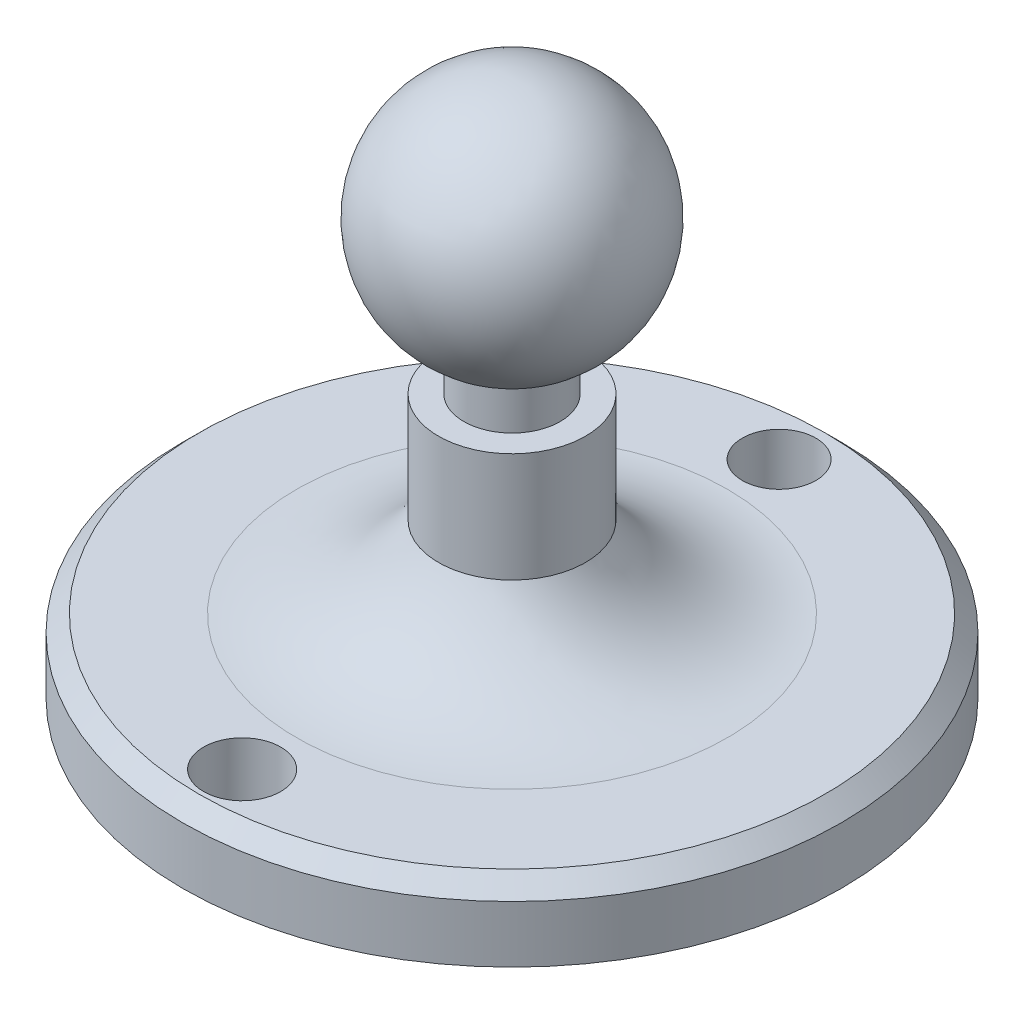
ISO-10303-21;
HEADER;
FILE_DESCRIPTION(('STEP AP214'),'2;1');
FILE_NAME('part.step','',(''),(''),'','','');
FILE_SCHEMA(('AUTOMOTIVE_DESIGN { 1 0 10303 214 1 1 1 1 }'));
ENDSEC;
DATA;
#1=APPLICATION_CONTEXT('core data for automotive mechanical design processes');
#2=APPLICATION_PROTOCOL_DEFINITION('international standard','automotive_design',2000,#1);
#3=PRODUCT_CONTEXT('',#1,'mechanical');
#4=PRODUCT('Part','Part','',(#3));
#5=PRODUCT_RELATED_PRODUCT_CATEGORY('part','',(#4));
#6=PRODUCT_DEFINITION_FORMATION('','',#4);
#7=PRODUCT_DEFINITION_CONTEXT('part definition',#1,'design');
#8=PRODUCT_DEFINITION('design','',#6,#7);
#9=PRODUCT_DEFINITION_SHAPE('','',#8);
#10=(LENGTH_UNIT() NAMED_UNIT(*) SI_UNIT(.MILLI.,.METRE.));
#11=(NAMED_UNIT(*) PLANE_ANGLE_UNIT() SI_UNIT($,.RADIAN.));
#12=(NAMED_UNIT(*) SI_UNIT($,.STERADIAN.) SOLID_ANGLE_UNIT());
#13=UNCERTAINTY_MEASURE_WITH_UNIT(LENGTH_MEASURE(1.E-05),#10,'distance_accuracy_value','');
#14=(GEOMETRIC_REPRESENTATION_CONTEXT(3) GLOBAL_UNCERTAINTY_ASSIGNED_CONTEXT((#13)) GLOBAL_UNIT_ASSIGNED_CONTEXT((#10,
#11,#12)) REPRESENTATION_CONTEXT('',''));
#15=CARTESIAN_POINT('',(0.,0.,0.));
#16=DIRECTION('',(0.,0.,1.));
#17=DIRECTION('',(1.,0.,0.));
#18=AXIS2_PLACEMENT_3D('',#15,#16,#17);
#19=CARTESIAN_POINT('',(0.,0.,0.));
#20=DIRECTION('',(0.,-1.,0.));
#21=DIRECTION('',(0.,0.,-1.));
#22=AXIS2_PLACEMENT_3D('',#19,#20,#21);
#23=PLANE('',#22);
#24=CARTESIAN_POINT('',(0.,0.,-81.0546907449684));
#25=DIRECTION('',(0.,-1.,0.));
#26=DIRECTION('',(0.,0.,-1.));
#27=AXIS2_PLACEMENT_3D('',#24,#25,#26);
#28=CIRCLE('',#27,11.163314546451);
#29=CARTESIAN_POINT('',(0.,0.,-92.2180052914194));
#30=VERTEX_POINT('',#29);
#31=EDGE_CURVE('E70',#30,#30,#28,.T.);
#32=ORIENTED_EDGE('',*,*,#31,.F.);
#33=EDGE_LOOP('',(#32));
#34=FACE_BOUND('',#33,.T.);
#35=CARTESIAN_POINT('',(0.,0.,81.8990104402285));
#36=DIRECTION('',(0.,-1.,0.));
#37=DIRECTION('',(0.,0.,-1.));
#38=AXIS2_PLACEMENT_3D('',#35,#36,#37);
#39=CIRCLE('',#38,11.7087538726197);
#40=CARTESIAN_POINT('',(0.,0.,70.1902565676088));
#41=VERTEX_POINT('',#40);
#42=EDGE_CURVE('E64',#41,#41,#39,.T.);
#43=ORIENTED_EDGE('',*,*,#42,.F.);
#44=EDGE_LOOP('',(#43));
#45=FACE_BOUND('',#44,.T.);
#46=CARTESIAN_POINT('',(0.,0.,0.));
#47=DIRECTION('',(0.,-1.,0.));
#48=DIRECTION('',(0.,0.,-1.));
#49=AXIS2_PLACEMENT_3D('',#46,#47,#48);
#50=CIRCLE('',#49,100.);
#51=CARTESIAN_POINT('',(0.,0.,-100.));
#52=VERTEX_POINT('',#51);
#53=EDGE_CURVE('E43',#52,#52,#50,.T.);
#54=ORIENTED_EDGE('',*,*,#53,.T.);
#55=EDGE_LOOP('',(#54));
#56=FACE_BOUND('',#55,.T.);
#57=ADVANCED_FACE('F32',(#34,#45,#56),#23,.T.);
#58=CARTESIAN_POINT('',(0.,0.,0.));
#59=DIRECTION('',(0.,-1.,0.));
#60=DIRECTION('',(0.,0.,-1.));
#61=AXIS2_PLACEMENT_3D('',#58,#59,#60);
#62=CYLINDRICAL_SURFACE('',#61,100.);
#63=CARTESIAN_POINT('',(0.,17.2445990685214,0.));
#64=DIRECTION('',(0.,1.,0.));
#65=DIRECTION('',(0.,0.,1.));
#66=AXIS2_PLACEMENT_3D('',#63,#64,#65);
#67=CIRCLE('',#66,100.);
#68=CARTESIAN_POINT('',(0.,17.2445990685214,100.));
#69=VERTEX_POINT('',#68);
#70=EDGE_CURVE('E39',#69,#69,#67,.F.);
#71=ORIENTED_EDGE('',*,*,#70,.T.);
#72=EDGE_LOOP('',(#71));
#73=FACE_BOUND('',#72,.T.);
#74=ORIENTED_EDGE('',*,*,#53,.F.);
#75=EDGE_LOOP('',(#74));
#76=FACE_BOUND('',#75,.T.);
#77=ADVANCED_FACE('F83',(#73,#76),#62,.T.);
#78=CARTESIAN_POINT('',(0.,22.2445990685214,-100.));
#79=DIRECTION('',(0.,1.,0.));
#80=DIRECTION('',(0.,0.,1.));
#81=AXIS2_PLACEMENT_3D('',#78,#79,#80);
#82=PLANE('',#81);
#83=CARTESIAN_POINT('',(0.,22.2445990685214,0.));
#84=DIRECTION('',(0.,1.,0.));
#85=DIRECTION('',(0.,0.,1.));
#86=AXIS2_PLACEMENT_3D('',#83,#84,#85);
#87=CIRCLE('',#86,95.);
#88=CARTESIAN_POINT('',(0.,22.2445990685214,95.));
#89=VERTEX_POINT('',#88);
#90=EDGE_CURVE('E10',#89,#89,#87,.T.);
#91=ORIENTED_EDGE('',*,*,#90,.T.);
#92=EDGE_LOOP('',(#91));
#93=FACE_BOUND('',#92,.T.);
#94=CARTESIAN_POINT('',(0.,22.2445990685214,-81.0546907449684));
#95=DIRECTION('',(0.,1.,0.));
#96=DIRECTION('',(0.,0.,1.));
#97=AXIS2_PLACEMENT_3D('',#94,#95,#96);
#98=CIRCLE('',#97,11.163314546451);
#99=CARTESIAN_POINT('',(0.,22.2445990685214,-69.8913761985174));
#100=VERTEX_POINT('',#99);
#101=EDGE_CURVE('E73',#100,#100,#98,.T.);
#102=ORIENTED_EDGE('',*,*,#101,.F.);
#103=EDGE_LOOP('',(#102));
#104=FACE_BOUND('',#103,.T.);
#105=CARTESIAN_POINT('',(0.,22.2445990685214,81.8990104402285));
#106=DIRECTION('',(0.,1.,0.));
#107=DIRECTION('',(0.,0.,1.));
#108=AXIS2_PLACEMENT_3D('',#105,#106,#107);
#109=CIRCLE('',#108,11.7087538726197);
#110=CARTESIAN_POINT('',(0.,22.2445990685214,93.6077643128483));
#111=VERTEX_POINT('',#110);
#112=EDGE_CURVE('E67',#111,#111,#109,.T.);
#113=ORIENTED_EDGE('',*,*,#112,.F.);
#114=EDGE_LOOP('',(#113));
#115=FACE_BOUND('',#114,.T.);
#116=CARTESIAN_POINT('',(0.,22.2445990685214,0.));
#117=DIRECTION('',(0.,-1.,0.));
#118=DIRECTION('',(0.,0.,-1.));
#119=AXIS2_PLACEMENT_3D('',#116,#117,#118);
#120=CIRCLE('',#119,65.3580623912063);
#121=CARTESIAN_POINT('',(0.,22.2445990685214,-65.3580623912063));
#122=VERTEX_POINT('',#121);
#123=EDGE_CURVE('E47',#122,#122,#120,.T.);
#124=ORIENTED_EDGE('',*,*,#123,.T.);
#125=EDGE_LOOP('',(#124));
#126=FACE_BOUND('',#125,.T.);
#127=ADVANCED_FACE('F79',(#93,#104,#115,#126),#82,.T.);
#128=CARTESIAN_POINT('',(0.,72.2373900874028,0.));
#129=DIRECTION('',(0.,-1.,0.));
#130=DIRECTION('',(0.,0.,-1.));
#131=AXIS2_PLACEMENT_3D('',#128,#129,#130);
#132=TOROIDAL_SURFACE('',#131,65.3580623912063,49.9927910188814);
#133=CARTESIAN_POINT('',(0.,46.8010358445021,0.));
#134=DIRECTION('',(0.,-1.,0.));
#135=DIRECTION('',(0.,0.,-1.));
#136=AXIS2_PLACEMENT_3D('',#133,#134,#135);
#137=CIRCLE('',#136,22.3200438879432);
#138=CARTESIAN_POINT('',(0.,46.8010358445021,-22.3200438879432));
#139=VERTEX_POINT('',#138);
#140=EDGE_CURVE('E52',#139,#139,#137,.T.);
#141=ORIENTED_EDGE('',*,*,#140,.T.);
#142=EDGE_LOOP('',(#141));
#143=FACE_BOUND('',#142,.T.);
#144=ORIENTED_EDGE('',*,*,#123,.F.);
#145=EDGE_LOOP('',(#144));
#146=FACE_BOUND('',#145,.T.);
#147=ADVANCED_FACE('F82',(#143,#146),#132,.F.);
#148=CARTESIAN_POINT('',(0.,0.,0.));
#149=DIRECTION('',(0.,-1.,0.));
#150=DIRECTION('',(0.,0.,-1.));
#151=AXIS2_PLACEMENT_3D('',#148,#149,#150);
#152=CYLINDRICAL_SURFACE('',#151,22.3200438879432);
#153=CARTESIAN_POINT('',(0.,80.,0.));
#154=DIRECTION('',(0.,-1.,0.));
#155=DIRECTION('',(0.,0.,-1.));
#156=AXIS2_PLACEMENT_3D('',#153,#154,#155);
#157=CIRCLE('',#156,22.3200438879432);
#158=CARTESIAN_POINT('',(0.,80.,-22.3200438879432));
#159=VERTEX_POINT('',#158);
#160=EDGE_CURVE('E55',#159,#159,#157,.T.);
#161=ORIENTED_EDGE('',*,*,#160,.T.);
#162=EDGE_LOOP('',(#161));
#163=FACE_BOUND('',#162,.T.);
#164=ORIENTED_EDGE('',*,*,#140,.F.);
#165=EDGE_LOOP('',(#164));
#166=FACE_BOUND('',#165,.T.);
#167=ADVANCED_FACE('F90',(#163,#166),#152,.T.);
#168=CARTESIAN_POINT('',(0.,80.,-22.3200438879432));
#169=DIRECTION('',(0.,1.,0.));
#170=DIRECTION('',(0.,0.,1.));
#171=AXIS2_PLACEMENT_3D('',#168,#169,#170);
#172=PLANE('',#171);
#173=CARTESIAN_POINT('',(0.,80.,0.));
#174=DIRECTION('',(0.,-1.,0.));
#175=DIRECTION('',(0.,0.,-1.));
#176=AXIS2_PLACEMENT_3D('',#173,#174,#175);
#177=CIRCLE('',#176,14.6298453410812);
#178=CARTESIAN_POINT('',(0.,80.,-14.6298453410812));
#179=VERTEX_POINT('',#178);
#180=EDGE_CURVE('E58',#179,#179,#177,.T.);
#181=ORIENTED_EDGE('',*,*,#180,.T.);
#182=EDGE_LOOP('',(#181));
#183=FACE_BOUND('',#182,.T.);
#184=ORIENTED_EDGE('',*,*,#160,.F.);
#185=EDGE_LOOP('',(#184));
#186=FACE_BOUND('',#185,.T.);
#187=ADVANCED_FACE('F96',(#183,#186),#172,.T.);
#188=CARTESIAN_POINT('',(0.,0.,0.));
#189=DIRECTION('',(0.,-1.,0.));
#190=DIRECTION('',(0.,0.,-1.));
#191=AXIS2_PLACEMENT_3D('',#188,#189,#190);
#192=CYLINDRICAL_SURFACE('',#191,14.6298453410812);
#193=CARTESIAN_POINT('',(0.,92.5205834792081,0.));
#194=DIRECTION('',(0.,-1.,0.));
#195=DIRECTION('',(0.,0.,-1.));
#196=AXIS2_PLACEMENT_3D('',#193,#194,#195);
#197=CIRCLE('',#196,14.6298453410812);
#198=CARTESIAN_POINT('',(0.,92.5205834792081,-14.6298453410812));
#199=VERTEX_POINT('',#198);
#200=EDGE_CURVE('E61',#199,#199,#197,.T.);
#201=ORIENTED_EDGE('',*,*,#200,.T.);
#202=EDGE_LOOP('',(#201));
#203=FACE_BOUND('',#202,.T.);
#204=ORIENTED_EDGE('',*,*,#180,.F.);
#205=EDGE_LOOP('',(#204));
#206=FACE_BOUND('',#205,.T.);
#207=ADVANCED_FACE('F123',(#203,#206),#192,.T.);
#208=CARTESIAN_POINT('',(0.,126.211803040533,0.));
#209=DIRECTION('',(0.,-1.,0.));
#210=DIRECTION('',(0.,0.,-1.));
#211=AXIS2_PLACEMENT_3D('',#208,#209,#210);
#212=SPHERICAL_SURFACE('',#211,36.7305138846894);
#213=ORIENTED_EDGE('',*,*,#200,.F.);
#214=EDGE_LOOP('',(#213));
#215=FACE_BOUND('',#214,.T.);
#216=ADVANCED_FACE('F115',(#215),#212,.T.);
#217=CARTESIAN_POINT('',(0.,-17.7554009314786,81.8990104402285));
#218=DIRECTION('',(0.,1.,0.));
#219=DIRECTION('',(0.,0.,1.));
#220=AXIS2_PLACEMENT_3D('',#217,#218,#219);
#221=CYLINDRICAL_SURFACE('',#220,11.7087538726197);
#222=ORIENTED_EDGE('',*,*,#42,.T.);
#223=EDGE_LOOP('',(#222));
#224=FACE_BOUND('',#223,.T.);
#225=ORIENTED_EDGE('',*,*,#112,.T.);
#226=EDGE_LOOP('',(#225));
#227=FACE_BOUND('',#226,.T.);
#228=ADVANCED_FACE('F112',(#224,#227),#221,.F.);
#229=CARTESIAN_POINT('',(0.,-17.7554009314786,-81.0546907449684));
#230=DIRECTION('',(0.,1.,0.));
#231=DIRECTION('',(0.,0.,1.));
#232=AXIS2_PLACEMENT_3D('',#229,#230,#231);
#233=CYLINDRICAL_SURFACE('',#232,11.163314546451);
#234=ORIENTED_EDGE('',*,*,#31,.T.);
#235=EDGE_LOOP('',(#234));
#236=FACE_BOUND('',#235,.T.);
#237=ORIENTED_EDGE('',*,*,#101,.T.);
#238=EDGE_LOOP('',(#237));
#239=FACE_BOUND('',#238,.T.);
#240=ADVANCED_FACE('F77',(#236,#239),#233,.F.);
#241=CARTESIAN_POINT('',(0.,17.2445990685214,0.));
#242=DIRECTION('',(0.,-1.,0.));
#243=DIRECTION('',(0.,0.,-1.));
#244=AXIS2_PLACEMENT_3D('',#241,#242,#243);
#245=CONICAL_SURFACE('',#244,100.,0.78539816339745);
#246=ORIENTED_EDGE('',*,*,#90,.F.);
#247=EDGE_LOOP('',(#246));
#248=FACE_BOUND('',#247,.T.);
#249=ORIENTED_EDGE('',*,*,#70,.F.);
#250=EDGE_LOOP('',(#249));
#251=FACE_BOUND('',#250,.T.);
#252=ADVANCED_FACE('F34',(#248,#251),#245,.T.);
#253=CLOSED_SHELL('',(#57,#77,#127,#147,#167,#187,#207,#216,#228,#240,#252));
#254=MANIFOLD_SOLID_BREP('B2',#253);
#255=ADVANCED_BREP_SHAPE_REPRESENTATION('',(#18,#254),#14);
#256=SHAPE_DEFINITION_REPRESENTATION(#9,#255);
ENDSEC;
END-ISO-10303-21;
